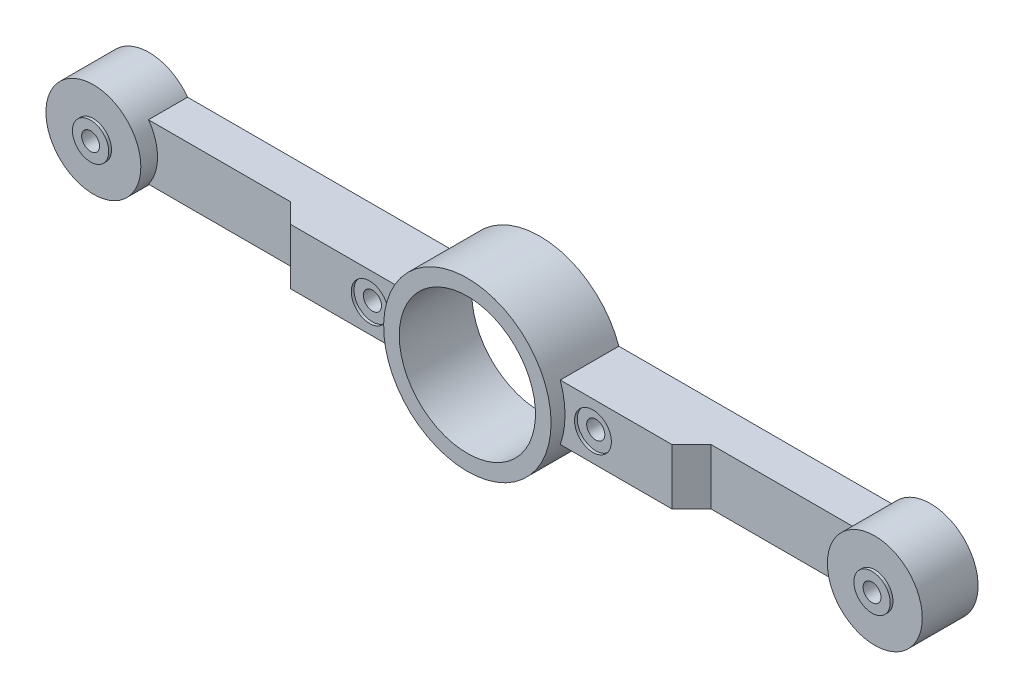
ISO-10303-21;
HEADER;
FILE_DESCRIPTION(('STEP AP214'),'2;1');
FILE_NAME('part.step','',(''),(''),'','','');
FILE_SCHEMA(('AUTOMOTIVE_DESIGN { 1 0 10303 214 1 1 1 1 }'));
ENDSEC;
DATA;
#1=APPLICATION_CONTEXT('core data for automotive mechanical design processes');
#2=APPLICATION_PROTOCOL_DEFINITION('international standard','automotive_design',2000,#1);
#3=PRODUCT_CONTEXT('',#1,'mechanical');
#4=PRODUCT('Part','Part','',(#3));
#5=PRODUCT_RELATED_PRODUCT_CATEGORY('part','',(#4));
#6=PRODUCT_DEFINITION_FORMATION('','',#4);
#7=PRODUCT_DEFINITION_CONTEXT('part definition',#1,'design');
#8=PRODUCT_DEFINITION('design','',#6,#7);
#9=PRODUCT_DEFINITION_SHAPE('','',#8);
#10=(LENGTH_UNIT() NAMED_UNIT(*) SI_UNIT(.MILLI.,.METRE.));
#11=(NAMED_UNIT(*) PLANE_ANGLE_UNIT() SI_UNIT($,.RADIAN.));
#12=(NAMED_UNIT(*) SI_UNIT($,.STERADIAN.) SOLID_ANGLE_UNIT());
#13=UNCERTAINTY_MEASURE_WITH_UNIT(LENGTH_MEASURE(1.E-05),#10,'distance_accuracy_value','');
#14=(GEOMETRIC_REPRESENTATION_CONTEXT(3) GLOBAL_UNCERTAINTY_ASSIGNED_CONTEXT((#13)) GLOBAL_UNIT_ASSIGNED_CONTEXT((#10,
#11,#12)) REPRESENTATION_CONTEXT('',''));
#15=CARTESIAN_POINT('',(0.,0.,0.));
#16=DIRECTION('',(0.,0.,1.));
#17=DIRECTION('',(1.,0.,0.));
#18=AXIS2_PLACEMENT_3D('',#15,#16,#17);
#19=CARTESIAN_POINT('',(70.,0.,6.));
#20=DIRECTION('',(0.,0.,1.));
#21=DIRECTION('',(1.,0.,0.));
#22=AXIS2_PLACEMENT_3D('',#19,#20,#21);
#23=PLANE('',#22);
#24=CARTESIAN_POINT('',(70.,0.,6.));
#25=DIRECTION('',(0.,0.,1.));
#26=DIRECTION('',(1.,0.,0.));
#27=AXIS2_PLACEMENT_3D('',#24,#25,#26);
#28=CIRCLE('',#27,8.5);
#29=CARTESIAN_POINT('',(78.5,0.,6.));
#30=VERTEX_POINT('',#29);
#31=EDGE_CURVE('E217',#30,#30,#28,.T.);
#32=ORIENTED_EDGE('',*,*,#31,.T.);
#33=EDGE_LOOP('',(#32));
#34=FACE_BOUND('',#33,.T.);
#35=CARTESIAN_POINT('',(70.,0.,6.));
#36=DIRECTION('',(0.,0.,1.));
#37=DIRECTION('',(1.,0.,0.));
#38=AXIS2_PLACEMENT_3D('',#35,#36,#37);
#39=CIRCLE('',#38,3.25000000000001);
#40=CARTESIAN_POINT('',(73.25,0.,6.));
#41=VERTEX_POINT('',#40);
#42=EDGE_CURVE('E336',#41,#41,#39,.T.);
#43=ORIENTED_EDGE('',*,*,#42,.F.);
#44=EDGE_LOOP('',(#43));
#45=FACE_BOUND('',#44,.T.);
#46=ADVANCED_FACE('F45',(#34,#45),#23,.T.);
#47=CARTESIAN_POINT('',(-70.,0.,6.));
#48=DIRECTION('',(0.,0.,1.));
#49=DIRECTION('',(1.,0.,0.));
#50=AXIS2_PLACEMENT_3D('',#47,#48,#49);
#51=PLANE('',#50);
#52=CARTESIAN_POINT('',(-70.,0.,6.));
#53=DIRECTION('',(0.,0.,1.));
#54=DIRECTION('',(1.,0.,0.));
#55=AXIS2_PLACEMENT_3D('',#52,#53,#54);
#56=CIRCLE('',#55,8.5);
#57=CARTESIAN_POINT('',(-61.5,0.,6.));
#58=VERTEX_POINT('',#57);
#59=EDGE_CURVE('E226',#58,#58,#56,.T.);
#60=ORIENTED_EDGE('',*,*,#59,.T.);
#61=EDGE_LOOP('',(#60));
#62=FACE_BOUND('',#61,.T.);
#63=CARTESIAN_POINT('',(-70.,0.,6.));
#64=DIRECTION('',(0.,0.,1.));
#65=DIRECTION('',(1.,0.,0.));
#66=AXIS2_PLACEMENT_3D('',#63,#64,#65);
#67=CIRCLE('',#66,3.25000000000001);
#68=CARTESIAN_POINT('',(-66.75,0.,6.));
#69=VERTEX_POINT('',#68);
#70=EDGE_CURVE('E351',#69,#69,#67,.T.);
#71=ORIENTED_EDGE('',*,*,#70,.F.);
#72=EDGE_LOOP('',(#71));
#73=FACE_BOUND('',#72,.T.);
#74=ADVANCED_FACE('F410',(#62,#73),#51,.T.);
#75=CARTESIAN_POINT('',(0.,0.,3.));
#76=DIRECTION('',(0.,0.,1.));
#77=DIRECTION('',(1.,0.,0.));
#78=AXIS2_PLACEMENT_3D('',#75,#76,#77);
#79=PLANE('',#78);
#80=DIRECTION('',(-1.,0.,0.));
#81=VECTOR('',#80,1.);
#82=CARTESIAN_POINT('',(14.1421356237309,5.,3.));
#83=LINE('',#82,#81);
#84=CARTESIAN_POINT('',(63.1261364575662,5.,3.));
#85=VERTEX_POINT('',#84);
#86=CARTESIAN_POINT('',(37.642135623731,5.,3.));
#87=VERTEX_POINT('',#86);
#88=EDGE_CURVE('E247',#85,#87,#83,.T.);
#89=ORIENTED_EDGE('',*,*,#88,.T.);
#90=DIRECTION('',(0.,-1.,0.));
#91=VECTOR('',#90,1.);
#92=CARTESIAN_POINT('',(37.642135623731,-5.,3.));
#93=LINE('',#92,#91);
#94=CARTESIAN_POINT('',(37.642135623731,-5.,3.));
#95=VERTEX_POINT('',#94);
#96=EDGE_CURVE('E280',#87,#95,#93,.T.);
#97=ORIENTED_EDGE('',*,*,#96,.T.);
#98=DIRECTION('',(1.,0.,0.));
#99=VECTOR('',#98,1.);
#100=CARTESIAN_POINT('',(14.1421356237309,-5.,3.));
#101=LINE('',#100,#99);
#102=CARTESIAN_POINT('',(63.1261364575662,-5.,3.));
#103=VERTEX_POINT('',#102);
#104=EDGE_CURVE('E244',#95,#103,#101,.T.);
#105=ORIENTED_EDGE('',*,*,#104,.T.);
#106=CARTESIAN_POINT('',(70.,0.,3.));
#107=DIRECTION('',(0.,0.,1.));
#108=DIRECTION('',(1.,0.,0.));
#109=AXIS2_PLACEMENT_3D('',#106,#107,#108);
#110=CIRCLE('',#109,8.5);
#111=EDGE_CURVE('E218',#85,#103,#110,.T.);
#112=ORIENTED_EDGE('',*,*,#111,.F.);
#113=EDGE_LOOP('',(#89,#97,#105,#112));
#114=FACE_BOUND('',#113,.T.);
#115=ADVANCED_FACE('F416',(#114),#79,.T.);
#116=DIRECTION('',(1.,0.,0.));
#117=VECTOR('',#116,1.);
#118=CARTESIAN_POINT('',(-14.1421356237309,-4.99999999999999,3.));
#119=LINE('',#118,#117);
#120=CARTESIAN_POINT('',(-63.1261364575662,-4.99999999999999,3.));
#121=VERTEX_POINT('',#120);
#122=CARTESIAN_POINT('',(-37.642135623731,-4.99999999999999,3.));
#123=VERTEX_POINT('',#122);
#124=EDGE_CURVE('E240',#121,#123,#119,.T.);
#125=ORIENTED_EDGE('',*,*,#124,.T.);
#126=DIRECTION('',(0.,1.,0.));
#127=VECTOR('',#126,1.);
#128=CARTESIAN_POINT('',(-37.642135623731,5.,3.));
#129=LINE('',#128,#127);
#130=CARTESIAN_POINT('',(-37.642135623731,5.,3.));
#131=VERTEX_POINT('',#130);
#132=EDGE_CURVE('E276',#123,#131,#129,.T.);
#133=ORIENTED_EDGE('',*,*,#132,.T.);
#134=DIRECTION('',(-1.,0.,0.));
#135=VECTOR('',#134,1.);
#136=CARTESIAN_POINT('',(-14.1421356237309,5.,3.));
#137=LINE('',#136,#135);
#138=CARTESIAN_POINT('',(-63.1261364575662,5.,3.));
#139=VERTEX_POINT('',#138);
#140=EDGE_CURVE('E237',#131,#139,#137,.T.);
#141=ORIENTED_EDGE('',*,*,#140,.T.);
#142=CARTESIAN_POINT('',(-70.,0.,3.));
#143=DIRECTION('',(0.,0.,1.));
#144=DIRECTION('',(1.,0.,0.));
#145=AXIS2_PLACEMENT_3D('',#142,#143,#144);
#146=CIRCLE('',#145,8.5);
#147=EDGE_CURVE('E222',#121,#139,#146,.T.);
#148=ORIENTED_EDGE('',*,*,#147,.F.);
#149=EDGE_LOOP('',(#125,#133,#141,#148));
#150=FACE_BOUND('',#149,.T.);
#151=ADVANCED_FACE('F429',(#150),#79,.T.);
#152=CARTESIAN_POINT('',(-14.1421356237309,5.,3.));
#153=DIRECTION('',(0.,-1.,0.));
#154=DIRECTION('',(0.,0.,-1.));
#155=AXIS2_PLACEMENT_3D('',#152,#153,#154);
#156=PLANE('',#155);
#157=DIRECTION('',(0.,0.,-1.));
#158=VECTOR('',#157,1.);
#159=CARTESIAN_POINT('',(-14.1421356237309,5.,3.));
#160=LINE('',#159,#158);
#161=CARTESIAN_POINT('',(-14.142135623731,5.,6.5));
#162=VERTEX_POINT('',#161);
#163=CARTESIAN_POINT('',(-14.1421356237309,5.,-4.));
#164=VERTEX_POINT('',#163);
#165=EDGE_CURVE('E266',#162,#164,#160,.T.);
#166=ORIENTED_EDGE('',*,*,#165,.T.);
#167=DIRECTION('',(1.,0.,0.));
#168=VECTOR('',#167,1.);
#169=CARTESIAN_POINT('',(0.,5.,-4.));
#170=LINE('',#169,#168);
#171=CARTESIAN_POINT('',(-63.1261364575662,5.,-4.));
#172=VERTEX_POINT('',#171);
#173=EDGE_CURVE('E186',#172,#164,#170,.T.);
#174=ORIENTED_EDGE('',*,*,#173,.F.);
#175=DIRECTION('',(0.,0.,-1.));
#176=VECTOR('',#175,1.);
#177=CARTESIAN_POINT('',(-63.1261364575662,5.,3.));
#178=LINE('',#177,#176);
#179=EDGE_CURVE('E263',#139,#172,#178,.T.);
#180=ORIENTED_EDGE('',*,*,#179,.F.);
#181=ORIENTED_EDGE('',*,*,#140,.F.);
#182=DIRECTION('',(-0.707106781186552,0.,-0.707106781186543));
#183=VECTOR('',#182,1.);
#184=CARTESIAN_POINT('',(-25.8921356237308,5.,14.75));
#185=LINE('',#184,#183);
#186=CARTESIAN_POINT('',(-34.142135623731,5.,6.5));
#187=VERTEX_POINT('',#186);
#188=EDGE_CURVE('E283',#131,#187,#185,.F.);
#189=ORIENTED_EDGE('',*,*,#188,.T.);
#190=DIRECTION('',(1.,0.,0.));
#191=VECTOR('',#190,1.);
#192=CARTESIAN_POINT('',(0.,5.,6.5));
#193=LINE('',#192,#191);
#194=EDGE_CURVE('E213',#187,#162,#193,.T.);
#195=ORIENTED_EDGE('',*,*,#194,.T.);
#196=EDGE_LOOP('',(#166,#174,#180,#181,#189,#195));
#197=FACE_BOUND('',#196,.T.);
#198=ADVANCED_FACE('F432',(#197),#156,.F.);
#199=CARTESIAN_POINT('',(-70.,0.,3.));
#200=DIRECTION('',(0.,0.,-1.));
#201=DIRECTION('',(-1.,0.,0.));
#202=AXIS2_PLACEMENT_3D('',#199,#200,#201);
#203=CYLINDRICAL_SURFACE('',#202,8.5);
#204=ORIENTED_EDGE('',*,*,#179,.T.);
#205=CARTESIAN_POINT('',(-70.,0.,-4.));
#206=DIRECTION('',(0.,0.,1.));
#207=DIRECTION('',(1.,0.,0.));
#208=AXIS2_PLACEMENT_3D('',#205,#206,#207);
#209=CIRCLE('',#208,8.5);
#210=CARTESIAN_POINT('',(-63.1261364575662,-4.99999999999999,-4.));
#211=VERTEX_POINT('',#210);
#212=EDGE_CURVE('E190',#172,#211,#209,.T.);
#213=ORIENTED_EDGE('',*,*,#212,.T.);
#214=DIRECTION('',(0.,0.,-1.));
#215=VECTOR('',#214,1.);
#216=CARTESIAN_POINT('',(-63.1261364575662,-4.99999999999999,3.));
#217=LINE('',#216,#215);
#218=EDGE_CURVE('E260',#121,#211,#217,.T.);
#219=ORIENTED_EDGE('',*,*,#218,.F.);
#220=ORIENTED_EDGE('',*,*,#147,.T.);
#221=EDGE_LOOP('',(#204,#213,#219,#220));
#222=FACE_BOUND('',#221,.T.);
#223=ORIENTED_EDGE('',*,*,#59,.F.);
#224=EDGE_LOOP('',(#223));
#225=FACE_BOUND('',#224,.T.);
#226=ADVANCED_FACE('F447',(#222,#225),#203,.T.);
#227=CARTESIAN_POINT('',(-14.1421356237309,-4.99999999999999,3.));
#228=DIRECTION('',(0.,1.,0.));
#229=DIRECTION('',(0.,0.,1.));
#230=AXIS2_PLACEMENT_3D('',#227,#228,#229);
#231=PLANE('',#230);
#232=ORIENTED_EDGE('',*,*,#218,.T.);
#233=DIRECTION('',(-1.,0.,0.));
#234=VECTOR('',#233,1.);
#235=CARTESIAN_POINT('',(0.,-4.99999999999999,-4.));
#236=LINE('',#235,#234);
#237=CARTESIAN_POINT('',(-14.142135623731,-4.99999999999999,-4.));
#238=VERTEX_POINT('',#237);
#239=EDGE_CURVE('E194',#238,#211,#236,.T.);
#240=ORIENTED_EDGE('',*,*,#239,.F.);
#241=DIRECTION('',(0.,0.,-1.));
#242=VECTOR('',#241,1.);
#243=CARTESIAN_POINT('',(-14.142135623731,-4.99999999999999,3.));
#244=LINE('',#243,#242);
#245=CARTESIAN_POINT('',(-14.142135623731,-4.99999999999997,6.5));
#246=VERTEX_POINT('',#245);
#247=EDGE_CURVE('E149',#246,#238,#244,.T.);
#248=ORIENTED_EDGE('',*,*,#247,.F.);
#249=DIRECTION('',(-1.,0.,0.));
#250=VECTOR('',#249,1.);
#251=CARTESIAN_POINT('',(0.,-4.99999999999999,6.5));
#252=LINE('',#251,#250);
#253=CARTESIAN_POINT('',(-34.142135623731,-4.99999999999999,6.5));
#254=VERTEX_POINT('',#253);
#255=EDGE_CURVE('E205',#246,#254,#252,.T.);
#256=ORIENTED_EDGE('',*,*,#255,.T.);
#257=DIRECTION('',(0.707106781186552,0.,0.707106781186543));
#258=VECTOR('',#257,1.);
#259=CARTESIAN_POINT('',(-25.8921356237308,-4.99999999999999,14.75));
#260=LINE('',#259,#258);
#261=EDGE_CURVE('E286',#254,#123,#260,.F.);
#262=ORIENTED_EDGE('',*,*,#261,.T.);
#263=ORIENTED_EDGE('',*,*,#124,.F.);
#264=EDGE_LOOP('',(#232,#240,#248,#256,#262,#263));
#265=FACE_BOUND('',#264,.T.);
#266=ADVANCED_FACE('F444',(#265),#231,.F.);
#267=CARTESIAN_POINT('',(0.,0.,3.));
#268=DIRECTION('',(0.,0.,-1.));
#269=DIRECTION('',(-1.,0.,0.));
#270=AXIS2_PLACEMENT_3D('',#267,#268,#269);
#271=CYLINDRICAL_SURFACE('',#270,15.);
#272=CARTESIAN_POINT('',(0.,0.,6.5));
#273=DIRECTION('',(0.,0.,-1.));
#274=DIRECTION('',(-1.,0.,0.));
#275=AXIS2_PLACEMENT_3D('',#272,#273,#274);
#276=CIRCLE('',#275,15.);
#277=CARTESIAN_POINT('',(14.1421356237309,5.,6.5));
#278=VERTEX_POINT('',#277);
#279=CARTESIAN_POINT('',(14.142135623731,-4.99999999999997,6.5));
#280=VERTEX_POINT('',#279);
#281=EDGE_CURVE('E273',#278,#280,#276,.T.);
#282=ORIENTED_EDGE('',*,*,#281,.F.);
#283=DIRECTION('',(0.,0.,-1.));
#284=VECTOR('',#283,1.);
#285=CARTESIAN_POINT('',(14.1421356237309,5.,3.));
#286=LINE('',#285,#284);
#287=CARTESIAN_POINT('',(14.1421356237309,5.,-4.));
#288=VERTEX_POINT('',#287);
#289=EDGE_CURVE('E250',#278,#288,#286,.T.);
#290=ORIENTED_EDGE('',*,*,#289,.T.);
#291=CARTESIAN_POINT('',(0.,0.,-4.));
#292=DIRECTION('',(0.,0.,1.));
#293=DIRECTION('',(1.,0.,0.));
#294=AXIS2_PLACEMENT_3D('',#291,#292,#293);
#295=CIRCLE('',#294,15.);
#296=EDGE_CURVE('E182',#288,#164,#295,.T.);
#297=ORIENTED_EDGE('',*,*,#296,.T.);
#298=ORIENTED_EDGE('',*,*,#165,.F.);
#299=CARTESIAN_POINT('',(0.,0.,6.5));
#300=DIRECTION('',(0.,0.,-1.));
#301=DIRECTION('',(-1.,0.,0.));
#302=AXIS2_PLACEMENT_3D('',#299,#300,#301);
#303=CIRCLE('',#302,15.);
#304=EDGE_CURVE('E269',#246,#162,#303,.T.);
#305=ORIENTED_EDGE('',*,*,#304,.F.);
#306=ORIENTED_EDGE('',*,*,#247,.T.);
#307=CARTESIAN_POINT('',(0.,0.,-4.));
#308=DIRECTION('',(0.,0.,1.));
#309=DIRECTION('',(1.,0.,0.));
#310=AXIS2_PLACEMENT_3D('',#307,#308,#309);
#311=CIRCLE('',#310,15.);
#312=CARTESIAN_POINT('',(14.1421356237309,-5.,-4.));
#313=VERTEX_POINT('',#312);
#314=EDGE_CURVE('E156',#238,#313,#311,.T.);
#315=ORIENTED_EDGE('',*,*,#314,.T.);
#316=DIRECTION('',(0.,0.,-1.));
#317=VECTOR('',#316,1.);
#318=CARTESIAN_POINT('',(14.1421356237309,-5.,3.));
#319=LINE('',#318,#317);
#320=EDGE_CURVE('E136',#280,#313,#319,.T.);
#321=ORIENTED_EDGE('',*,*,#320,.F.);
#322=EDGE_LOOP('',(#282,#290,#297,#298,#305,#306,#315,#321));
#323=FACE_BOUND('',#322,.T.);
#324=CARTESIAN_POINT('',(0.,0.,9.));
#325=DIRECTION('',(0.,0.,1.));
#326=DIRECTION('',(1.,0.,0.));
#327=AXIS2_PLACEMENT_3D('',#324,#325,#326);
#328=CIRCLE('',#327,15.);
#329=CARTESIAN_POINT('',(15.,0.,9.));
#330=VERTEX_POINT('',#329);
#331=EDGE_CURVE('E230',#330,#330,#328,.T.);
#332=ORIENTED_EDGE('',*,*,#331,.F.);
#333=EDGE_LOOP('',(#332));
#334=FACE_BOUND('',#333,.T.);
#335=ADVANCED_FACE('F162',(#323,#334),#271,.T.);
#336=CARTESIAN_POINT('',(14.1421356237309,-5.,3.));
#337=DIRECTION('',(0.,1.,0.));
#338=DIRECTION('',(0.,0.,1.));
#339=AXIS2_PLACEMENT_3D('',#336,#337,#338);
#340=PLANE('',#339);
#341=ORIENTED_EDGE('',*,*,#320,.T.);
#342=DIRECTION('',(-1.,0.,0.));
#343=VECTOR('',#342,1.);
#344=CARTESIAN_POINT('',(0.,-5.,-4.));
#345=LINE('',#344,#343);
#346=CARTESIAN_POINT('',(63.1261364575662,-5.,-4.));
#347=VERTEX_POINT('',#346);
#348=EDGE_CURVE('E140',#347,#313,#345,.T.);
#349=ORIENTED_EDGE('',*,*,#348,.F.);
#350=DIRECTION('',(0.,0.,-1.));
#351=VECTOR('',#350,1.);
#352=CARTESIAN_POINT('',(63.1261364575662,-5.,3.));
#353=LINE('',#352,#351);
#354=EDGE_CURVE('E150',#103,#347,#353,.T.);
#355=ORIENTED_EDGE('',*,*,#354,.F.);
#356=ORIENTED_EDGE('',*,*,#104,.F.);
#357=DIRECTION('',(0.707106781186552,0.,-0.707106781186543));
#358=VECTOR('',#357,1.);
#359=CARTESIAN_POINT('',(25.8921356237308,-5.,14.75));
#360=LINE('',#359,#358);
#361=CARTESIAN_POINT('',(34.142135623731,-4.99999999999997,6.5));
#362=VERTEX_POINT('',#361);
#363=EDGE_CURVE('E56',#95,#362,#360,.F.);
#364=ORIENTED_EDGE('',*,*,#363,.T.);
#365=DIRECTION('',(-1.,0.,0.));
#366=VECTOR('',#365,1.);
#367=CARTESIAN_POINT('',(0.,-4.99999999999997,6.5));
#368=LINE('',#367,#366);
#369=EDGE_CURVE('E143',#362,#280,#368,.T.);
#370=ORIENTED_EDGE('',*,*,#369,.T.);
#371=EDGE_LOOP('',(#341,#349,#355,#356,#364,#370));
#372=FACE_BOUND('',#371,.T.);
#373=ADVANCED_FACE('F138',(#372),#340,.F.);
#374=CARTESIAN_POINT('',(70.,0.,3.));
#375=DIRECTION('',(0.,0.,-1.));
#376=DIRECTION('',(-1.,0.,0.));
#377=AXIS2_PLACEMENT_3D('',#374,#375,#376);
#378=CYLINDRICAL_SURFACE('',#377,8.5);
#379=ORIENTED_EDGE('',*,*,#354,.T.);
#380=CARTESIAN_POINT('',(70.,0.,-4.));
#381=DIRECTION('',(0.,0.,1.));
#382=DIRECTION('',(1.,0.,0.));
#383=AXIS2_PLACEMENT_3D('',#380,#381,#382);
#384=CIRCLE('',#383,8.5);
#385=CARTESIAN_POINT('',(63.1261364575662,5.,-4.));
#386=VERTEX_POINT('',#385);
#387=EDGE_CURVE('E159',#347,#386,#384,.T.);
#388=ORIENTED_EDGE('',*,*,#387,.T.);
#389=DIRECTION('',(0.,0.,-1.));
#390=VECTOR('',#389,1.);
#391=CARTESIAN_POINT('',(63.1261364575662,5.,3.));
#392=LINE('',#391,#390);
#393=EDGE_CURVE('E253',#85,#386,#392,.T.);
#394=ORIENTED_EDGE('',*,*,#393,.F.);
#395=ORIENTED_EDGE('',*,*,#111,.T.);
#396=EDGE_LOOP('',(#379,#388,#394,#395));
#397=FACE_BOUND('',#396,.T.);
#398=ORIENTED_EDGE('',*,*,#31,.F.);
#399=EDGE_LOOP('',(#398));
#400=FACE_BOUND('',#399,.T.);
#401=ADVANCED_FACE('F436',(#397,#400),#378,.T.);
#402=CARTESIAN_POINT('',(14.1421356237309,5.,3.));
#403=DIRECTION('',(0.,-1.,0.));
#404=DIRECTION('',(0.,0.,-1.));
#405=AXIS2_PLACEMENT_3D('',#402,#403,#404);
#406=PLANE('',#405);
#407=ORIENTED_EDGE('',*,*,#393,.T.);
#408=DIRECTION('',(1.,0.,0.));
#409=VECTOR('',#408,1.);
#410=CARTESIAN_POINT('',(0.,5.,-4.));
#411=LINE('',#410,#409);
#412=EDGE_CURVE('E179',#288,#386,#411,.T.);
#413=ORIENTED_EDGE('',*,*,#412,.F.);
#414=ORIENTED_EDGE('',*,*,#289,.F.);
#415=DIRECTION('',(1.,0.,0.));
#416=VECTOR('',#415,1.);
#417=CARTESIAN_POINT('',(0.,5.00000000000001,6.5));
#418=LINE('',#417,#416);
#419=CARTESIAN_POINT('',(34.142135623731,5.00000000000001,6.5));
#420=VERTEX_POINT('',#419);
#421=EDGE_CURVE('E200',#278,#420,#418,.T.);
#422=ORIENTED_EDGE('',*,*,#421,.T.);
#423=DIRECTION('',(-0.707106781186552,0.,0.707106781186543));
#424=VECTOR('',#423,1.);
#425=CARTESIAN_POINT('',(25.8921356237308,5.,14.75));
#426=LINE('',#425,#424);
#427=EDGE_CURVE('E11',#420,#87,#426,.F.);
#428=ORIENTED_EDGE('',*,*,#427,.T.);
#429=ORIENTED_EDGE('',*,*,#88,.F.);
#430=EDGE_LOOP('',(#407,#413,#414,#422,#428,#429));
#431=FACE_BOUND('',#430,.T.);
#432=ADVANCED_FACE('F427',(#431),#406,.F.);
#433=CARTESIAN_POINT('',(0.,0.,9.));
#434=DIRECTION('',(0.,0.,1.));
#435=DIRECTION('',(1.,0.,0.));
#436=AXIS2_PLACEMENT_3D('',#433,#434,#435);
#437=PLANE('',#436);
#438=CARTESIAN_POINT('',(0.,0.,9.));
#439=DIRECTION('',(0.,0.,1.));
#440=DIRECTION('',(1.,0.,0.));
#441=AXIS2_PLACEMENT_3D('',#438,#439,#440);
#442=CIRCLE('',#441,12.2);
#443=CARTESIAN_POINT('',(-12.2,0.,9.));
#444=VERTEX_POINT('',#443);
#445=EDGE_CURVE('E308',#444,#444,#442,.T.);
#446=ORIENTED_EDGE('',*,*,#445,.F.);
#447=EDGE_LOOP('',(#446));
#448=FACE_BOUND('',#447,.T.);
#449=ORIENTED_EDGE('',*,*,#331,.T.);
#450=EDGE_LOOP('',(#449));
#451=FACE_BOUND('',#450,.T.);
#452=ADVANCED_FACE('F424',(#448,#451),#437,.T.);
#453=CARTESIAN_POINT('',(0.,0.,6.5));
#454=DIRECTION('',(0.,0.,-1.));
#455=DIRECTION('',(-1.,0.,0.));
#456=AXIS2_PLACEMENT_3D('',#453,#454,#455);
#457=PLANE('',#456);
#458=CARTESIAN_POINT('',(-20.,0.,6.5));
#459=DIRECTION('',(0.,0.,-1.));
#460=DIRECTION('',(-1.,0.,0.));
#461=AXIS2_PLACEMENT_3D('',#458,#459,#460);
#462=CIRCLE('',#461,3.3);
#463=CARTESIAN_POINT('',(-23.3,0.,6.5));
#464=VERTEX_POINT('',#463);
#465=EDGE_CURVE('E379',#464,#464,#462,.T.);
#466=ORIENTED_EDGE('',*,*,#465,.T.);
#467=EDGE_LOOP('',(#466));
#468=FACE_BOUND('',#467,.T.);
#469=ORIENTED_EDGE('',*,*,#255,.F.);
#470=ORIENTED_EDGE('',*,*,#304,.T.);
#471=ORIENTED_EDGE('',*,*,#194,.F.);
#472=DIRECTION('',(0.,1.,0.));
#473=VECTOR('',#472,1.);
#474=CARTESIAN_POINT('',(-34.142135623731,0.,6.5));
#475=LINE('',#474,#473);
#476=EDGE_CURVE('E209',#254,#187,#475,.T.);
#477=ORIENTED_EDGE('',*,*,#476,.F.);
#478=EDGE_LOOP('',(#469,#470,#471,#477));
#479=FACE_BOUND('',#478,.T.);
#480=ADVANCED_FACE('F421',(#468,#479),#457,.F.);
#481=CARTESIAN_POINT('',(0.,0.,6.5));
#482=DIRECTION('',(0.,0.,-1.));
#483=DIRECTION('',(-1.,0.,0.));
#484=AXIS2_PLACEMENT_3D('',#481,#482,#483);
#485=PLANE('',#484);
#486=CARTESIAN_POINT('',(20.,0.,6.5));
#487=DIRECTION('',(0.,0.,-1.));
#488=DIRECTION('',(-1.,0.,0.));
#489=AXIS2_PLACEMENT_3D('',#486,#487,#488);
#490=CIRCLE('',#489,3.3);
#491=CARTESIAN_POINT('',(16.7,0.,6.5));
#492=VERTEX_POINT('',#491);
#493=EDGE_CURVE('E382',#492,#492,#490,.T.);
#494=ORIENTED_EDGE('',*,*,#493,.T.);
#495=EDGE_LOOP('',(#494));
#496=FACE_BOUND('',#495,.T.);
#497=ORIENTED_EDGE('',*,*,#421,.F.);
#498=ORIENTED_EDGE('',*,*,#281,.T.);
#499=ORIENTED_EDGE('',*,*,#369,.F.);
#500=DIRECTION('',(0.,-1.,0.));
#501=VECTOR('',#500,1.);
#502=CARTESIAN_POINT('',(34.142135623731,0.,6.5));
#503=LINE('',#502,#501);
#504=EDGE_CURVE('E197',#420,#362,#503,.T.);
#505=ORIENTED_EDGE('',*,*,#504,.F.);
#506=EDGE_LOOP('',(#497,#498,#499,#505));
#507=FACE_BOUND('',#506,.T.);
#508=ADVANCED_FACE('F459',(#496,#507),#485,.F.);
#509=CARTESIAN_POINT('',(-37.642135623731,0.,3.));
#510=DIRECTION('',(-0.707106781186543,0.,0.707106781186552));
#511=DIRECTION('',(0.,-1.,0.));
#512=AXIS2_PLACEMENT_3D('',#509,#510,#511);
#513=PLANE('',#512);
#514=ORIENTED_EDGE('',*,*,#261,.F.);
#515=ORIENTED_EDGE('',*,*,#476,.T.);
#516=ORIENTED_EDGE('',*,*,#188,.F.);
#517=ORIENTED_EDGE('',*,*,#132,.F.);
#518=EDGE_LOOP('',(#514,#515,#516,#517));
#519=FACE_BOUND('',#518,.T.);
#520=ADVANCED_FACE('F455',(#519),#513,.T.);
#521=CARTESIAN_POINT('',(37.642135623731,0.,3.));
#522=DIRECTION('',(0.707106781186543,0.,0.707106781186552));
#523=DIRECTION('',(0.,1.,0.));
#524=AXIS2_PLACEMENT_3D('',#521,#522,#523);
#525=PLANE('',#524);
#526=ORIENTED_EDGE('',*,*,#427,.F.);
#527=ORIENTED_EDGE('',*,*,#504,.T.);
#528=ORIENTED_EDGE('',*,*,#363,.F.);
#529=ORIENTED_EDGE('',*,*,#96,.F.);
#530=EDGE_LOOP('',(#526,#527,#528,#529));
#531=FACE_BOUND('',#530,.T.);
#532=ADVANCED_FACE('F48',(#531),#525,.T.);
#533=CARTESIAN_POINT('',(0.,0.,-4.));
#534=DIRECTION('',(0.,0.,1.));
#535=DIRECTION('',(1.,0.,0.));
#536=AXIS2_PLACEMENT_3D('',#533,#534,#535);
#537=PLANE('',#536);
#538=CARTESIAN_POINT('',(-20.,0.,-4.));
#539=DIRECTION('',(0.,0.,1.));
#540=DIRECTION('',(1.,0.,0.));
#541=AXIS2_PLACEMENT_3D('',#538,#539,#540);
#542=CIRCLE('',#541,3.3);
#543=CARTESIAN_POINT('',(-16.7,0.,-4.));
#544=VERTEX_POINT('',#543);
#545=EDGE_CURVE('E320',#544,#544,#542,.T.);
#546=ORIENTED_EDGE('',*,*,#545,.T.);
#547=EDGE_LOOP('',(#546));
#548=FACE_BOUND('',#547,.T.);
#549=CARTESIAN_POINT('',(20.,0.,-4.));
#550=DIRECTION('',(0.,0.,1.));
#551=DIRECTION('',(1.,0.,0.));
#552=AXIS2_PLACEMENT_3D('',#549,#550,#551);
#553=CIRCLE('',#552,3.3);
#554=CARTESIAN_POINT('',(23.3,0.,-4.));
#555=VERTEX_POINT('',#554);
#556=EDGE_CURVE('E326',#555,#555,#553,.T.);
#557=ORIENTED_EDGE('',*,*,#556,.T.);
#558=EDGE_LOOP('',(#557));
#559=FACE_BOUND('',#558,.T.);
#560=CARTESIAN_POINT('',(0.,0.,-4.));
#561=DIRECTION('',(0.,0.,1.));
#562=DIRECTION('',(1.,0.,0.));
#563=AXIS2_PLACEMENT_3D('',#560,#561,#562);
#564=CIRCLE('',#563,12.2);
#565=CARTESIAN_POINT('',(-12.2,0.,-4.));
#566=VERTEX_POINT('',#565);
#567=EDGE_CURVE('E304',#566,#566,#564,.F.);
#568=ORIENTED_EDGE('',*,*,#567,.F.);
#569=EDGE_LOOP('',(#568));
#570=FACE_BOUND('',#569,.T.);
#571=CARTESIAN_POINT('',(-70.,0.,-4.));
#572=DIRECTION('',(0.,0.,1.));
#573=DIRECTION('',(1.,0.,0.));
#574=AXIS2_PLACEMENT_3D('',#571,#572,#573);
#575=CIRCLE('',#574,3.3);
#576=CARTESIAN_POINT('',(-66.7,0.,-4.));
#577=VERTEX_POINT('',#576);
#578=EDGE_CURVE('E365',#577,#577,#575,.T.);
#579=ORIENTED_EDGE('',*,*,#578,.T.);
#580=EDGE_LOOP('',(#579));
#581=FACE_BOUND('',#580,.T.);
#582=CARTESIAN_POINT('',(70.,0.,-4.));
#583=DIRECTION('',(0.,0.,1.));
#584=DIRECTION('',(1.,0.,0.));
#585=AXIS2_PLACEMENT_3D('',#582,#583,#584);
#586=CIRCLE('',#585,3.3);
#587=CARTESIAN_POINT('',(73.3,0.,-4.));
#588=VERTEX_POINT('',#587);
#589=EDGE_CURVE('E369',#588,#588,#586,.T.);
#590=ORIENTED_EDGE('',*,*,#589,.T.);
#591=EDGE_LOOP('',(#590));
#592=FACE_BOUND('',#591,.T.);
#593=ORIENTED_EDGE('',*,*,#314,.F.);
#594=ORIENTED_EDGE('',*,*,#239,.T.);
#595=ORIENTED_EDGE('',*,*,#212,.F.);
#596=ORIENTED_EDGE('',*,*,#173,.T.);
#597=ORIENTED_EDGE('',*,*,#296,.F.);
#598=ORIENTED_EDGE('',*,*,#412,.T.);
#599=ORIENTED_EDGE('',*,*,#387,.F.);
#600=ORIENTED_EDGE('',*,*,#348,.T.);
#601=EDGE_LOOP('',(#593,#594,#595,#596,#597,#598,#599,#600));
#602=FACE_BOUND('',#601,.T.);
#603=ADVANCED_FACE('F154',(#548,#559,#570,#581,#592,#602),#537,.F.);
#604=CARTESIAN_POINT('',(20.,0.,9.));
#605=DIRECTION('',(0.,0.,-1.));
#606=DIRECTION('',(-1.,0.,0.));
#607=AXIS2_PLACEMENT_3D('',#604,#605,#606);
#608=CYLINDRICAL_SURFACE('',#607,1.625);
#609=CARTESIAN_POINT('',(20.,0.,-0.999999999999999));
#610=DIRECTION('',(0.,0.,1.));
#611=DIRECTION('',(1.,0.,0.));
#612=AXIS2_PLACEMENT_3D('',#609,#610,#611);
#613=CIRCLE('',#612,1.625);
#614=CARTESIAN_POINT('',(21.625,0.,-0.999999999999999));
#615=VERTEX_POINT('',#614);
#616=EDGE_CURVE('E50',#615,#615,#613,.T.);
#617=ORIENTED_EDGE('',*,*,#616,.F.);
#618=EDGE_LOOP('',(#617));
#619=FACE_BOUND('',#618,.T.);
#620=CARTESIAN_POINT('',(20.,0.,6.));
#621=DIRECTION('',(0.,0.,-1.));
#622=DIRECTION('',(-1.,0.,0.));
#623=AXIS2_PLACEMENT_3D('',#620,#621,#622);
#624=CIRCLE('',#623,1.625);
#625=CARTESIAN_POINT('',(18.375,0.,6.));
#626=VERTEX_POINT('',#625);
#627=EDGE_CURVE('E167',#626,#626,#624,.T.);
#628=ORIENTED_EDGE('',*,*,#627,.F.);
#629=EDGE_LOOP('',(#628));
#630=FACE_BOUND('',#629,.T.);
#631=ADVANCED_FACE('F774',(#619,#630),#608,.F.);
#632=CARTESIAN_POINT('',(-20.,0.,9.));
#633=DIRECTION('',(0.,0.,-1.));
#634=DIRECTION('',(-1.,0.,0.));
#635=AXIS2_PLACEMENT_3D('',#632,#633,#634);
#636=CYLINDRICAL_SURFACE('',#635,1.625);
#637=CARTESIAN_POINT('',(-20.,0.,-0.999999999999999));
#638=DIRECTION('',(0.,0.,1.));
#639=DIRECTION('',(1.,0.,0.));
#640=AXIS2_PLACEMENT_3D('',#637,#638,#639);
#641=CIRCLE('',#640,1.625);
#642=CARTESIAN_POINT('',(-18.375,0.,-0.999999999999999));
#643=VERTEX_POINT('',#642);
#644=EDGE_CURVE('E309',#643,#643,#641,.T.);
#645=ORIENTED_EDGE('',*,*,#644,.F.);
#646=EDGE_LOOP('',(#645));
#647=FACE_BOUND('',#646,.T.);
#648=CARTESIAN_POINT('',(-20.,0.,6.));
#649=DIRECTION('',(0.,0.,-1.));
#650=DIRECTION('',(-1.,0.,0.));
#651=AXIS2_PLACEMENT_3D('',#648,#649,#650);
#652=CIRCLE('',#651,1.625);
#653=CARTESIAN_POINT('',(-21.625,0.,6.));
#654=VERTEX_POINT('',#653);
#655=EDGE_CURVE('E171',#654,#654,#652,.T.);
#656=ORIENTED_EDGE('',*,*,#655,.F.);
#657=EDGE_LOOP('',(#656));
#658=FACE_BOUND('',#657,.T.);
#659=ADVANCED_FACE('F740',(#647,#658),#636,.F.);
#660=CARTESIAN_POINT('',(70.,0.,9.));
#661=DIRECTION('',(0.,0.,-1.));
#662=DIRECTION('',(-1.,0.,0.));
#663=AXIS2_PLACEMENT_3D('',#660,#661,#662);
#664=CYLINDRICAL_SURFACE('',#663,1.60000000000001);
#665=CARTESIAN_POINT('',(70.,0.,-3.));
#666=DIRECTION('',(0.,0.,1.));
#667=DIRECTION('',(1.,0.,0.));
#668=AXIS2_PLACEMENT_3D('',#665,#666,#667);
#669=CIRCLE('',#668,1.60000000000001);
#670=CARTESIAN_POINT('',(71.6,0.,-3.));
#671=VERTEX_POINT('',#670);
#672=EDGE_CURVE('E299',#671,#671,#669,.T.);
#673=ORIENTED_EDGE('',*,*,#672,.F.);
#674=EDGE_LOOP('',(#673));
#675=FACE_BOUND('',#674,.T.);
#676=CARTESIAN_POINT('',(70.,0.,6.5));
#677=DIRECTION('',(0.,0.,1.));
#678=DIRECTION('',(1.,0.,0.));
#679=AXIS2_PLACEMENT_3D('',#676,#677,#678);
#680=CIRCLE('',#679,1.6);
#681=CARTESIAN_POINT('',(71.6,0.,6.5));
#682=VERTEX_POINT('',#681);
#683=EDGE_CURVE('E340',#682,#682,#680,.T.);
#684=ORIENTED_EDGE('',*,*,#683,.T.);
#685=EDGE_LOOP('',(#684));
#686=FACE_BOUND('',#685,.T.);
#687=ADVANCED_FACE('F728',(#675,#686),#664,.F.);
#688=CARTESIAN_POINT('',(-70.,0.,9.));
#689=DIRECTION('',(0.,0.,-1.));
#690=DIRECTION('',(-1.,0.,0.));
#691=AXIS2_PLACEMENT_3D('',#688,#689,#690);
#692=CYLINDRICAL_SURFACE('',#691,1.60000000000001);
#693=CARTESIAN_POINT('',(-70.,0.,-3.));
#694=DIRECTION('',(0.,0.,1.));
#695=DIRECTION('',(1.,0.,0.));
#696=AXIS2_PLACEMENT_3D('',#693,#694,#695);
#697=CIRCLE('',#696,1.60000000000001);
#698=CARTESIAN_POINT('',(-68.4,0.,-3.));
#699=VERTEX_POINT('',#698);
#700=EDGE_CURVE('E295',#699,#699,#697,.T.);
#701=ORIENTED_EDGE('',*,*,#700,.F.);
#702=EDGE_LOOP('',(#701));
#703=FACE_BOUND('',#702,.T.);
#704=CARTESIAN_POINT('',(-70.,0.,6.5));
#705=DIRECTION('',(0.,0.,1.));
#706=DIRECTION('',(1.,0.,0.));
#707=AXIS2_PLACEMENT_3D('',#704,#705,#706);
#708=CIRCLE('',#707,1.6);
#709=CARTESIAN_POINT('',(-68.4,0.,6.5));
#710=VERTEX_POINT('',#709);
#711=EDGE_CURVE('E347',#710,#710,#708,.T.);
#712=ORIENTED_EDGE('',*,*,#711,.T.);
#713=EDGE_LOOP('',(#712));
#714=FACE_BOUND('',#713,.T.);
#715=ADVANCED_FACE('F551',(#703,#714),#692,.F.);
#716=CARTESIAN_POINT('',(-20.,0.,6.));
#717=DIRECTION('',(0.,0.,1.));
#718=DIRECTION('',(1.,0.,0.));
#719=AXIS2_PLACEMENT_3D('',#716,#717,#718);
#720=CYLINDRICAL_SURFACE('',#719,3.3);
#721=CARTESIAN_POINT('',(-20.,0.,6.));
#722=DIRECTION('',(0.,0.,-1.));
#723=DIRECTION('',(-1.,0.,0.));
#724=AXIS2_PLACEMENT_3D('',#721,#722,#723);
#725=CIRCLE('',#724,3.3);
#726=CARTESIAN_POINT('',(-23.3,0.,6.));
#727=VERTEX_POINT('',#726);
#728=EDGE_CURVE('E293',#727,#727,#725,.T.);
#729=ORIENTED_EDGE('',*,*,#728,.T.);
#730=EDGE_LOOP('',(#729));
#731=FACE_BOUND('',#730,.T.);
#732=ORIENTED_EDGE('',*,*,#465,.F.);
#733=EDGE_LOOP('',(#732));
#734=FACE_BOUND('',#733,.T.);
#735=ADVANCED_FACE('F546',(#731,#734),#720,.F.);
#736=CARTESIAN_POINT('',(-20.,0.,6.));
#737=DIRECTION('',(0.,0.,-1.));
#738=DIRECTION('',(-1.,0.,0.));
#739=AXIS2_PLACEMENT_3D('',#736,#737,#738);
#740=PLANE('',#739);
#741=ORIENTED_EDGE('',*,*,#655,.T.);
#742=EDGE_LOOP('',(#741));
#743=FACE_BOUND('',#742,.T.);
#744=ORIENTED_EDGE('',*,*,#728,.F.);
#745=EDGE_LOOP('',(#744));
#746=FACE_BOUND('',#745,.T.);
#747=ADVANCED_FACE('F406',(#743,#746),#740,.F.);
#748=CARTESIAN_POINT('',(20.,0.,6.));
#749=DIRECTION('',(0.,0.,1.));
#750=DIRECTION('',(1.,0.,0.));
#751=AXIS2_PLACEMENT_3D('',#748,#749,#750);
#752=CYLINDRICAL_SURFACE('',#751,3.3);
#753=CARTESIAN_POINT('',(20.,0.,6.));
#754=DIRECTION('',(0.,0.,-1.));
#755=DIRECTION('',(-1.,0.,0.));
#756=AXIS2_PLACEMENT_3D('',#753,#754,#755);
#757=CIRCLE('',#756,3.3);
#758=CARTESIAN_POINT('',(16.7,0.,6.));
#759=VERTEX_POINT('',#758);
#760=EDGE_CURVE('E174',#759,#759,#757,.T.);
#761=ORIENTED_EDGE('',*,*,#760,.T.);
#762=EDGE_LOOP('',(#761));
#763=FACE_BOUND('',#762,.T.);
#764=ORIENTED_EDGE('',*,*,#493,.F.);
#765=EDGE_LOOP('',(#764));
#766=FACE_BOUND('',#765,.T.);
#767=ADVANCED_FACE('F391',(#763,#766),#752,.F.);
#768=CARTESIAN_POINT('',(20.,0.,6.));
#769=DIRECTION('',(0.,0.,-1.));
#770=DIRECTION('',(-1.,0.,0.));
#771=AXIS2_PLACEMENT_3D('',#768,#769,#770);
#772=PLANE('',#771);
#773=ORIENTED_EDGE('',*,*,#627,.T.);
#774=EDGE_LOOP('',(#773));
#775=FACE_BOUND('',#774,.T.);
#776=ORIENTED_EDGE('',*,*,#760,.F.);
#777=EDGE_LOOP('',(#776));
#778=FACE_BOUND('',#777,.T.);
#779=ADVANCED_FACE('F394',(#775,#778),#772,.F.);
#780=CARTESIAN_POINT('',(-70.,0.,-3.));
#781=DIRECTION('',(0.,0.,-1.));
#782=DIRECTION('',(-1.,0.,0.));
#783=AXIS2_PLACEMENT_3D('',#780,#781,#782);
#784=CYLINDRICAL_SURFACE('',#783,3.3);
#785=CARTESIAN_POINT('',(-70.,0.,-3.));
#786=DIRECTION('',(0.,0.,1.));
#787=DIRECTION('',(1.,0.,0.));
#788=AXIS2_PLACEMENT_3D('',#785,#786,#787);
#789=CIRCLE('',#788,3.3);
#790=CARTESIAN_POINT('',(-66.7,0.,-3.));
#791=VERTEX_POINT('',#790);
#792=EDGE_CURVE('E300',#791,#791,#789,.T.);
#793=ORIENTED_EDGE('',*,*,#792,.T.);
#794=EDGE_LOOP('',(#793));
#795=FACE_BOUND('',#794,.T.);
#796=ORIENTED_EDGE('',*,*,#578,.F.);
#797=EDGE_LOOP('',(#796));
#798=FACE_BOUND('',#797,.T.);
#799=ADVANCED_FACE('F396',(#795,#798),#784,.F.);
#800=CARTESIAN_POINT('',(-70.,0.,-3.));
#801=DIRECTION('',(0.,0.,1.));
#802=DIRECTION('',(1.,0.,0.));
#803=AXIS2_PLACEMENT_3D('',#800,#801,#802);
#804=PLANE('',#803);
#805=ORIENTED_EDGE('',*,*,#700,.T.);
#806=EDGE_LOOP('',(#805));
#807=FACE_BOUND('',#806,.T.);
#808=ORIENTED_EDGE('',*,*,#792,.F.);
#809=EDGE_LOOP('',(#808));
#810=FACE_BOUND('',#809,.T.);
#811=ADVANCED_FACE('F403',(#807,#810),#804,.F.);
#812=CARTESIAN_POINT('',(70.,0.,-3.));
#813=DIRECTION('',(0.,0.,-1.));
#814=DIRECTION('',(-1.,0.,0.));
#815=AXIS2_PLACEMENT_3D('',#812,#813,#814);
#816=CYLINDRICAL_SURFACE('',#815,3.3);
#817=CARTESIAN_POINT('',(70.,0.,-3.));
#818=DIRECTION('',(0.,0.,1.));
#819=DIRECTION('',(1.,0.,0.));
#820=AXIS2_PLACEMENT_3D('',#817,#818,#819);
#821=CIRCLE('',#820,3.3);
#822=CARTESIAN_POINT('',(73.3,0.,-3.));
#823=VERTEX_POINT('',#822);
#824=EDGE_CURVE('E307',#823,#823,#821,.T.);
#825=ORIENTED_EDGE('',*,*,#824,.T.);
#826=EDGE_LOOP('',(#825));
#827=FACE_BOUND('',#826,.T.);
#828=ORIENTED_EDGE('',*,*,#589,.F.);
#829=EDGE_LOOP('',(#828));
#830=FACE_BOUND('',#829,.T.);
#831=ADVANCED_FACE('F593',(#827,#830),#816,.F.);
#832=CARTESIAN_POINT('',(70.,0.,-3.));
#833=DIRECTION('',(0.,0.,1.));
#834=DIRECTION('',(1.,0.,0.));
#835=AXIS2_PLACEMENT_3D('',#832,#833,#834);
#836=PLANE('',#835);
#837=ORIENTED_EDGE('',*,*,#672,.T.);
#838=EDGE_LOOP('',(#837));
#839=FACE_BOUND('',#838,.T.);
#840=ORIENTED_EDGE('',*,*,#824,.F.);
#841=EDGE_LOOP('',(#840));
#842=FACE_BOUND('',#841,.T.);
#843=ADVANCED_FACE('F603',(#839,#842),#836,.F.);
#844=CARTESIAN_POINT('',(0.,0.,9.));
#845=DIRECTION('',(0.,0.,-1.));
#846=DIRECTION('',(-1.,0.,0.));
#847=AXIS2_PLACEMENT_3D('',#844,#845,#846);
#848=CYLINDRICAL_SURFACE('',#847,12.2);
#849=CARTESIAN_POINT('',(-12.2,0.,9.));
#850=CARTESIAN_POINT('',(-12.2,0.,8.86458333333333));
#851=CARTESIAN_POINT('',(-12.2,0.,8.72916666666667));
#852=CARTESIAN_POINT('',(-12.2,0.,8.45833333333333));
#853=CARTESIAN_POINT('',(-12.2,0.,8.32291666666667));
#854=CARTESIAN_POINT('',(-12.2,0.,8.05208333333333));
#855=CARTESIAN_POINT('',(-12.2,0.,7.91666666666667));
#856=CARTESIAN_POINT('',(-12.2,0.,7.64583333333333));
#857=CARTESIAN_POINT('',(-12.2,0.,7.51041666666667));
#858=CARTESIAN_POINT('',(-12.2,0.,7.23958333333333));
#859=CARTESIAN_POINT('',(-12.2,0.,7.10416666666667));
#860=CARTESIAN_POINT('',(-12.2,0.,6.83333333333333));
#861=CARTESIAN_POINT('',(-12.2,0.,6.69791666666667));
#862=CARTESIAN_POINT('',(-12.2,0.,6.42708333333333));
#863=CARTESIAN_POINT('',(-12.2,0.,6.29166666666667));
#864=CARTESIAN_POINT('',(-12.2,0.,6.02083333333333));
#865=CARTESIAN_POINT('',(-12.2,0.,5.88541666666666));
#866=CARTESIAN_POINT('',(-12.2,0.,5.61458333333333));
#867=CARTESIAN_POINT('',(-12.2,0.,5.47916666666667));
#868=CARTESIAN_POINT('',(-12.2,0.,5.20833333333333));
#869=CARTESIAN_POINT('',(-12.2,0.,5.07291666666667));
#870=CARTESIAN_POINT('',(-12.2,0.,4.80208333333333));
#871=CARTESIAN_POINT('',(-12.2,0.,4.66666666666667));
#872=CARTESIAN_POINT('',(-12.2,0.,4.39583333333333));
#873=CARTESIAN_POINT('',(-12.2,0.,4.26041666666667));
#874=CARTESIAN_POINT('',(-12.2,0.,3.98958333333333));
#875=CARTESIAN_POINT('',(-12.2,0.,3.85416666666667));
#876=CARTESIAN_POINT('',(-12.2,0.,3.58333333333333));
#877=CARTESIAN_POINT('',(-12.2,0.,3.44791666666667));
#878=CARTESIAN_POINT('',(-12.2,0.,3.17708333333333));
#879=CARTESIAN_POINT('',(-12.2,0.,3.04166666666667));
#880=CARTESIAN_POINT('',(-12.2,0.,2.77083333333333));
#881=CARTESIAN_POINT('',(-12.2,0.,2.63541666666667));
#882=CARTESIAN_POINT('',(-12.2,0.,2.36458333333333));
#883=CARTESIAN_POINT('',(-12.2,0.,2.22916666666667));
#884=CARTESIAN_POINT('',(-12.2,0.,1.95833333333333));
#885=CARTESIAN_POINT('',(-12.2,0.,1.82291666666667));
#886=CARTESIAN_POINT('',(-12.2,0.,1.55208333333333));
#887=CARTESIAN_POINT('',(-12.2,0.,1.41666666666667));
#888=CARTESIAN_POINT('',(-12.2,0.,1.14583333333333));
#889=CARTESIAN_POINT('',(-12.2,0.,1.01041666666667));
#890=CARTESIAN_POINT('',(-12.2,0.,0.739583333333334));
#891=CARTESIAN_POINT('',(-12.2,0.,0.604166666666667));
#892=CARTESIAN_POINT('',(-12.2,0.,0.333333333333334));
#893=CARTESIAN_POINT('',(-12.2,0.,0.197916666666667));
#894=CARTESIAN_POINT('',(-12.2,0.,-0.0729166666666667));
#895=CARTESIAN_POINT('',(-12.2,0.,-0.208333333333334));
#896=CARTESIAN_POINT('',(-12.2,0.,-0.479166666666667));
#897=CARTESIAN_POINT('',(-12.2,0.,-0.614583333333334));
#898=CARTESIAN_POINT('',(-12.2,0.,-0.885416666666667));
#899=CARTESIAN_POINT('',(-12.2,0.,-1.02083333333333));
#900=CARTESIAN_POINT('',(-12.2,0.,-1.29166666666667));
#901=CARTESIAN_POINT('',(-12.2,0.,-1.42708333333333));
#902=CARTESIAN_POINT('',(-12.2,0.,-1.69791666666667));
#903=CARTESIAN_POINT('',(-12.2,0.,-1.83333333333333));
#904=CARTESIAN_POINT('',(-12.2,0.,-2.10416666666667));
#905=CARTESIAN_POINT('',(-12.2,0.,-2.23958333333333));
#906=CARTESIAN_POINT('',(-12.2,0.,-2.51041666666667));
#907=CARTESIAN_POINT('',(-12.2,0.,-2.64583333333333));
#908=CARTESIAN_POINT('',(-12.2,0.,-2.91666666666667));
#909=CARTESIAN_POINT('',(-12.2,0.,-3.05208333333333));
#910=CARTESIAN_POINT('',(-12.2,0.,-3.32291666666667));
#911=CARTESIAN_POINT('',(-12.2,0.,-3.45833333333333));
#912=CARTESIAN_POINT('',(-12.2,0.,-3.72916666666667));
#913=CARTESIAN_POINT('',(-12.2,0.,-3.86458333333333));
#914=CARTESIAN_POINT('',(-12.2,0.,-4.));
#915=B_SPLINE_CURVE_WITH_KNOTS('',3,(#849,#850,#851,#852,#853,#854,#855,#856,#857,#858,#859,
#860,#861,#862,#863,#864,#865,#866,#867,#868,#869,#870,#871,#872,#873,#874,#875,#876,#877,#878,
#879,#880,#881,#882,#883,#884,#885,#886,#887,#888,#889,#890,#891,#892,#893,#894,#895,#896,#897,
#898,#899,#900,#901,#902,#903,#904,#905,#906,#907,#908,#909,#910,#911,#912,#913,#914),
.UNSPECIFIED.,.F.,.F.,(4,2,2,2,2,2,2,2,2,2,2,2,2,2,2,2,2,2,2,2,2,2,2,2,2,2,2,2,2,2,2,2,4),(0.,
0.40625,0.812500000000001,1.21875,1.625,2.03125,2.4375,2.84375,3.25,3.65625,4.0625,4.46875,
4.875,5.28125,5.6875,6.09375,6.5,6.90625,7.3125,7.71875,8.125,8.53125,8.9375,9.34375,9.75,
10.15625,10.5625,10.96875,11.375,11.78125,12.1875,12.59375,13.),.UNSPECIFIED.);
#916=EDGE_CURVE('BSEAM613',#444,#566,#915,.T.);
#917=ORIENTED_EDGE('',*,*,#445,.T.);
#918=ORIENTED_EDGE('',*,*,#567,.T.);
#919=ORIENTED_EDGE('',*,*,#916,.T.);
#920=ORIENTED_EDGE('',*,*,#916,.F.);
#921=EDGE_LOOP('',(#917,#919,#918,#920));
#922=FACE_BOUND('',#921,.T.);
#923=ADVANCED_FACE('F613',(#922),#848,.F.);
#924=CARTESIAN_POINT('',(-70.,0.,6.5));
#925=DIRECTION('',(0.,0.,1.));
#926=DIRECTION('',(1.,0.,0.));
#927=AXIS2_PLACEMENT_3D('',#924,#925,#926);
#928=PLANE('',#927);
#929=CARTESIAN_POINT('',(-70.,0.,6.5));
#930=DIRECTION('',(0.,0.,1.));
#931=DIRECTION('',(1.,0.,0.));
#932=AXIS2_PLACEMENT_3D('',#929,#930,#931);
#933=CIRCLE('',#932,3.25000000000001);
#934=CARTESIAN_POINT('',(-66.75,0.,6.5));
#935=VERTEX_POINT('',#934);
#936=EDGE_CURVE('E352',#935,#935,#933,.T.);
#937=ORIENTED_EDGE('',*,*,#936,.T.);
#938=EDGE_LOOP('',(#937));
#939=FACE_BOUND('',#938,.T.);
#940=ORIENTED_EDGE('',*,*,#711,.F.);
#941=EDGE_LOOP('',(#940));
#942=FACE_BOUND('',#941,.T.);
#943=ADVANCED_FACE('F624',(#939,#942),#928,.T.);
#944=CARTESIAN_POINT('',(-70.,0.,6.5));
#945=DIRECTION('',(0.,0.,-1.));
#946=DIRECTION('',(-1.,0.,0.));
#947=AXIS2_PLACEMENT_3D('',#944,#945,#946);
#948=CYLINDRICAL_SURFACE('',#947,3.25000000000001);
#949=ORIENTED_EDGE('',*,*,#936,.F.);
#950=EDGE_LOOP('',(#949));
#951=FACE_BOUND('',#950,.T.);
#952=ORIENTED_EDGE('',*,*,#70,.T.);
#953=EDGE_LOOP('',(#952));
#954=FACE_BOUND('',#953,.T.);
#955=ADVANCED_FACE('F631',(#951,#954),#948,.T.);
#956=CARTESIAN_POINT('',(70.,0.,6.5));
#957=DIRECTION('',(0.,0.,1.));
#958=DIRECTION('',(1.,0.,0.));
#959=AXIS2_PLACEMENT_3D('',#956,#957,#958);
#960=PLANE('',#959);
#961=CARTESIAN_POINT('',(70.,0.,6.5));
#962=DIRECTION('',(0.,0.,1.));
#963=DIRECTION('',(1.,0.,0.));
#964=AXIS2_PLACEMENT_3D('',#961,#962,#963);
#965=CIRCLE('',#964,3.25000000000001);
#966=CARTESIAN_POINT('',(73.25,0.,6.5));
#967=VERTEX_POINT('',#966);
#968=EDGE_CURVE('E318',#967,#967,#965,.T.);
#969=ORIENTED_EDGE('',*,*,#968,.T.);
#970=EDGE_LOOP('',(#969));
#971=FACE_BOUND('',#970,.T.);
#972=ORIENTED_EDGE('',*,*,#683,.F.);
#973=EDGE_LOOP('',(#972));
#974=FACE_BOUND('',#973,.T.);
#975=ADVANCED_FACE('F640',(#971,#974),#960,.T.);
#976=CARTESIAN_POINT('',(70.,0.,6.5));
#977=DIRECTION('',(0.,0.,-1.));
#978=DIRECTION('',(-1.,0.,0.));
#979=AXIS2_PLACEMENT_3D('',#976,#977,#978);
#980=CYLINDRICAL_SURFACE('',#979,3.25000000000001);
#981=ORIENTED_EDGE('',*,*,#968,.F.);
#982=EDGE_LOOP('',(#981));
#983=FACE_BOUND('',#982,.T.);
#984=ORIENTED_EDGE('',*,*,#42,.T.);
#985=EDGE_LOOP('',(#984));
#986=FACE_BOUND('',#985,.T.);
#987=ADVANCED_FACE('F648',(#983,#986),#980,.T.);
#988=CARTESIAN_POINT('',(-20.,0.,-1.));
#989=DIRECTION('',(0.,0.,-1.));
#990=DIRECTION('',(-1.,0.,0.));
#991=AXIS2_PLACEMENT_3D('',#988,#989,#990);
#992=CYLINDRICAL_SURFACE('',#991,3.3);
#993=CARTESIAN_POINT('',(-20.,0.,-1.));
#994=DIRECTION('',(0.,0.,1.));
#995=DIRECTION('',(1.,0.,0.));
#996=AXIS2_PLACEMENT_3D('',#993,#994,#995);
#997=CIRCLE('',#996,3.3);
#998=CARTESIAN_POINT('',(-16.7,0.,-1.));
#999=VERTEX_POINT('',#998);
#1000=EDGE_CURVE('E312',#999,#999,#997,.T.);
#1001=ORIENTED_EDGE('',*,*,#1000,.T.);
#1002=EDGE_LOOP('',(#1001));
#1003=FACE_BOUND('',#1002,.T.);
#1004=ORIENTED_EDGE('',*,*,#545,.F.);
#1005=EDGE_LOOP('',(#1004));
#1006=FACE_BOUND('',#1005,.T.);
#1007=ADVANCED_FACE('F656',(#1003,#1006),#992,.F.);
#1008=CARTESIAN_POINT('',(-20.,0.,-1.));
#1009=DIRECTION('',(0.,0.,1.));
#1010=DIRECTION('',(1.,0.,0.));
#1011=AXIS2_PLACEMENT_3D('',#1008,#1009,#1010);
#1012=PLANE('',#1011);
#1013=ORIENTED_EDGE('',*,*,#644,.T.);
#1014=EDGE_LOOP('',(#1013));
#1015=FACE_BOUND('',#1014,.T.);
#1016=ORIENTED_EDGE('',*,*,#1000,.F.);
#1017=EDGE_LOOP('',(#1016));
#1018=FACE_BOUND('',#1017,.T.);
#1019=ADVANCED_FACE('F665',(#1015,#1018),#1012,.F.);
#1020=CARTESIAN_POINT('',(20.,0.,-1.));
#1021=DIRECTION('',(0.,0.,-1.));
#1022=DIRECTION('',(-1.,0.,0.));
#1023=AXIS2_PLACEMENT_3D('',#1020,#1021,#1022);
#1024=CYLINDRICAL_SURFACE('',#1023,3.3);
#1025=CARTESIAN_POINT('',(20.,0.,-1.));
#1026=DIRECTION('',(0.,0.,1.));
#1027=DIRECTION('',(1.,0.,0.));
#1028=AXIS2_PLACEMENT_3D('',#1025,#1026,#1027);
#1029=CIRCLE('',#1028,3.3);
#1030=CARTESIAN_POINT('',(23.3,0.,-1.));
#1031=VERTEX_POINT('',#1030);
#1032=EDGE_CURVE('E332',#1031,#1031,#1029,.T.);
#1033=ORIENTED_EDGE('',*,*,#1032,.T.);
#1034=EDGE_LOOP('',(#1033));
#1035=FACE_BOUND('',#1034,.T.);
#1036=ORIENTED_EDGE('',*,*,#556,.F.);
#1037=EDGE_LOOP('',(#1036));
#1038=FACE_BOUND('',#1037,.T.);
#1039=ADVANCED_FACE('F673',(#1035,#1038),#1024,.F.);
#1040=CARTESIAN_POINT('',(20.,0.,-1.));
#1041=DIRECTION('',(0.,0.,1.));
#1042=DIRECTION('',(1.,0.,0.));
#1043=AXIS2_PLACEMENT_3D('',#1040,#1041,#1042);
#1044=PLANE('',#1043);
#1045=ORIENTED_EDGE('',*,*,#616,.T.);
#1046=EDGE_LOOP('',(#1045));
#1047=FACE_BOUND('',#1046,.T.);
#1048=ORIENTED_EDGE('',*,*,#1032,.F.);
#1049=EDGE_LOOP('',(#1048));
#1050=FACE_BOUND('',#1049,.T.);
#1051=ADVANCED_FACE('F680',(#1047,#1050),#1044,.F.);
#1052=CLOSED_SHELL('',(#46,#74,#115,#151,#198,#226,#266,#335,#373,#401,#432,#452,#480,#508,#520,
#532,#603,#631,#659,#687,#715,#735,#747,#767,#779,#799,#811,#831,#843,#923,#943,#955,#975,#987,
#1007,#1019,#1039,#1051));
#1053=MANIFOLD_SOLID_BREP('B2',#1052);
#1054=ADVANCED_BREP_SHAPE_REPRESENTATION('',(#18,#1053),#14);
#1055=SHAPE_DEFINITION_REPRESENTATION(#9,#1054);
ENDSEC;
END-ISO-10303-21;
